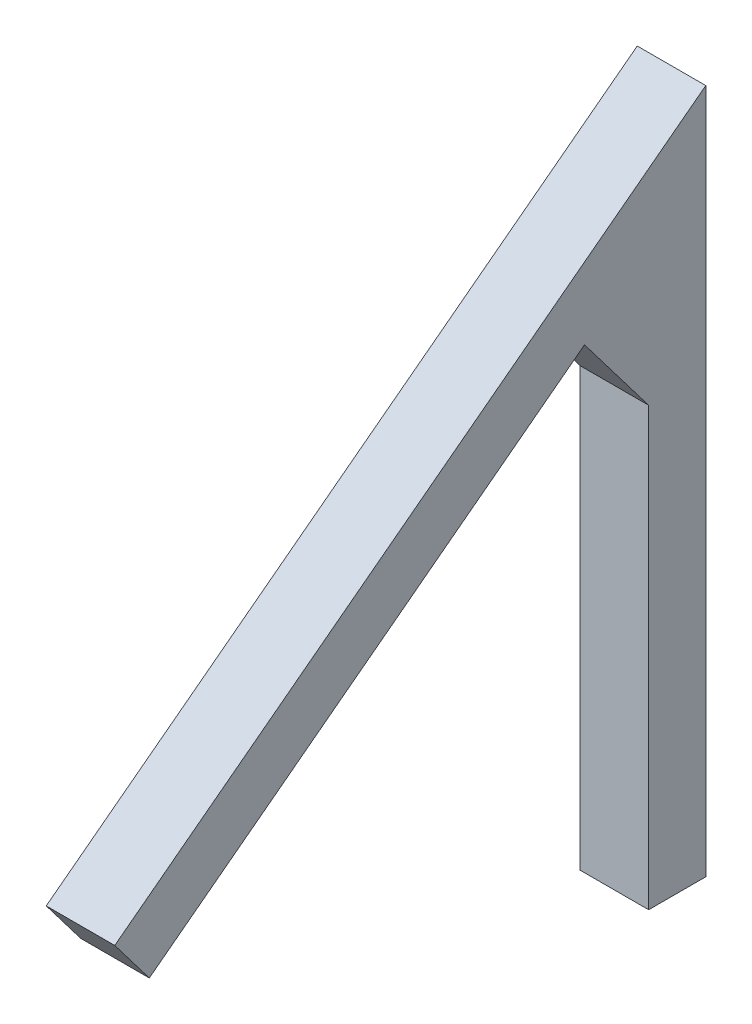
ISO-10303-21;
HEADER;
FILE_DESCRIPTION(('STEP AP214'),'2;1');
FILE_NAME('part.step','',(''),(''),'','','');
FILE_SCHEMA(('AUTOMOTIVE_DESIGN { 1 0 10303 214 1 1 1 1 }'));
ENDSEC;
DATA;
#1=APPLICATION_CONTEXT('core data for automotive mechanical design processes');
#2=APPLICATION_PROTOCOL_DEFINITION('international standard','automotive_design',2000,#1);
#3=PRODUCT_CONTEXT('',#1,'mechanical');
#4=PRODUCT('Part','Part','',(#3));
#5=PRODUCT_RELATED_PRODUCT_CATEGORY('part','',(#4));
#6=PRODUCT_DEFINITION_FORMATION('','',#4);
#7=PRODUCT_DEFINITION_CONTEXT('part definition',#1,'design');
#8=PRODUCT_DEFINITION('design','',#6,#7);
#9=PRODUCT_DEFINITION_SHAPE('','',#8);
#10=(LENGTH_UNIT() NAMED_UNIT(*) SI_UNIT(.MILLI.,.METRE.));
#11=(NAMED_UNIT(*) PLANE_ANGLE_UNIT() SI_UNIT($,.RADIAN.));
#12=(NAMED_UNIT(*) SI_UNIT($,.STERADIAN.) SOLID_ANGLE_UNIT());
#13=UNCERTAINTY_MEASURE_WITH_UNIT(LENGTH_MEASURE(1.E-05),#10,'distance_accuracy_value','');
#14=(GEOMETRIC_REPRESENTATION_CONTEXT(3) GLOBAL_UNCERTAINTY_ASSIGNED_CONTEXT((#13)) GLOBAL_UNIT_ASSIGNED_CONTEXT((#10,
#11,#12)) REPRESENTATION_CONTEXT('',''));
#15=CARTESIAN_POINT('',(0.,0.,0.));
#16=DIRECTION('',(0.,0.,1.));
#17=DIRECTION('',(1.,0.,0.));
#18=AXIS2_PLACEMENT_3D('',#15,#16,#17);
#19=CARTESIAN_POINT('',(6.,-14.9683199920836,4.99999999999995));
#20=DIRECTION('',(0.,1.,0.));
#21=DIRECTION('',(0.,0.,1.));
#22=AXIS2_PLACEMENT_3D('',#19,#20,#21);
#23=PLANE('',#22);
#24=DIRECTION('',(0.,0.,-1.));
#25=VECTOR('',#24,1.);
#26=CARTESIAN_POINT('',(0.,-14.9683199920836,4.99999999999995));
#27=LINE('',#26,#25);
#28=CARTESIAN_POINT('',(0.,-14.9683199920836,4.99999999999995));
#29=VERTEX_POINT('',#28);
#30=CARTESIAN_POINT('',(0.,-14.9683199920836,0.));
#31=VERTEX_POINT('',#30);
#32=EDGE_CURVE('E134',#29,#31,#27,.T.);
#33=ORIENTED_EDGE('',*,*,#32,.T.);
#34=DIRECTION('',(-1.,0.,0.));
#35=VECTOR('',#34,1.);
#36=CARTESIAN_POINT('',(6.,-14.9683199920836,0.));
#37=LINE('',#36,#35);
#38=CARTESIAN_POINT('',(6.,-14.9683199920836,0.));
#39=VERTEX_POINT('',#38);
#40=EDGE_CURVE('E11',#39,#31,#37,.T.);
#41=ORIENTED_EDGE('',*,*,#40,.F.);
#42=DIRECTION('',(0.,0.,-1.));
#43=VECTOR('',#42,1.);
#44=CARTESIAN_POINT('',(6.,-14.9683199920836,4.99999999999995));
#45=LINE('',#44,#43);
#46=CARTESIAN_POINT('',(6.,-14.9683199920836,4.99999999999995));
#47=VERTEX_POINT('',#46);
#48=EDGE_CURVE('E153',#47,#39,#45,.T.);
#49=ORIENTED_EDGE('',*,*,#48,.F.);
#50=DIRECTION('',(-1.,0.,0.));
#51=VECTOR('',#50,1.);
#52=CARTESIAN_POINT('',(6.,-14.9683199920836,4.99999999999995));
#53=LINE('',#52,#51);
#54=EDGE_CURVE('E130',#47,#29,#53,.T.);
#55=ORIENTED_EDGE('',*,*,#54,.T.);
#56=EDGE_LOOP('',(#33,#41,#49,#55));
#57=FACE_BOUND('',#56,.T.);
#58=ADVANCED_FACE('F39',(#57),#23,.F.);
#59=CARTESIAN_POINT('',(6.,-14.9683199920836,0.));
#60=DIRECTION('',(0.,0.,1.));
#61=DIRECTION('',(0.,-1.,0.));
#62=AXIS2_PLACEMENT_3D('',#59,#60,#61);
#63=PLANE('',#62);
#64=DIRECTION('',(0.,1.,0.));
#65=VECTOR('',#64,1.);
#66=CARTESIAN_POINT('',(0.,-14.9683199920836,0.));
#67=LINE('',#66,#65);
#68=CARTESIAN_POINT('',(0.,45.0316800079164,0.));
#69=VERTEX_POINT('',#68);
#70=EDGE_CURVE('E138',#31,#69,#67,.T.);
#71=ORIENTED_EDGE('',*,*,#70,.T.);
#72=DIRECTION('',(-1.,0.,0.));
#73=VECTOR('',#72,1.);
#74=CARTESIAN_POINT('',(6.,45.0316800079164,0.));
#75=LINE('',#74,#73);
#76=CARTESIAN_POINT('',(6.,45.0316800079164,0.));
#77=VERTEX_POINT('',#76);
#78=EDGE_CURVE('E48',#77,#69,#75,.T.);
#79=ORIENTED_EDGE('',*,*,#78,.F.);
#80=DIRECTION('',(0.,1.,0.));
#81=VECTOR('',#80,1.);
#82=CARTESIAN_POINT('',(6.,-14.9683199920836,0.));
#83=LINE('',#82,#81);
#84=EDGE_CURVE('E96',#39,#77,#83,.T.);
#85=ORIENTED_EDGE('',*,*,#84,.F.);
#86=ORIENTED_EDGE('',*,*,#40,.T.);
#87=EDGE_LOOP('',(#71,#79,#85,#86));
#88=FACE_BOUND('',#87,.T.);
#89=ADVANCED_FACE('F187',(#88),#63,.F.);
#90=CARTESIAN_POINT('',(6.,45.0316800079164,0.));
#91=DIRECTION('',(0.,-0.796162194123098,-0.605083267533564));
#92=DIRECTION('',(0.,0.605083267533564,-0.796162194123098));
#93=AXIS2_PLACEMENT_3D('',#90,#91,#92);
#94=PLANE('',#93);
#95=DIRECTION('',(0.,-0.605083267533564,0.796162194123098));
#96=VECTOR('',#95,1.);
#97=CARTESIAN_POINT('',(0.,45.0316800079164,0.));
#98=LINE('',#97,#96);
#99=CARTESIAN_POINT('',(0.,5.70126761823477,51.7505426180013));
#100=VERTEX_POINT('',#99);
#101=EDGE_CURVE('E141',#69,#100,#98,.T.);
#102=ORIENTED_EDGE('',*,*,#101,.T.);
#103=DIRECTION('',(-1.,0.,0.));
#104=VECTOR('',#103,1.);
#105=CARTESIAN_POINT('',(6.,5.70126761823477,51.7505426180013));
#106=LINE('',#105,#104);
#107=CARTESIAN_POINT('',(6.,5.70126761823477,51.7505426180013));
#108=VERTEX_POINT('',#107);
#109=EDGE_CURVE('E160',#108,#100,#106,.T.);
#110=ORIENTED_EDGE('',*,*,#109,.F.);
#111=DIRECTION('',(0.,-0.605083267533564,0.796162194123098));
#112=VECTOR('',#111,1.);
#113=CARTESIAN_POINT('',(6.,45.0316800079164,0.));
#114=LINE('',#113,#112);
#115=EDGE_CURVE('E170',#77,#108,#114,.T.);
#116=ORIENTED_EDGE('',*,*,#115,.F.);
#117=ORIENTED_EDGE('',*,*,#78,.T.);
#118=EDGE_LOOP('',(#102,#110,#116,#117));
#119=FACE_BOUND('',#118,.T.);
#120=ADVANCED_FACE('F168',(#119),#94,.F.);
#121=CARTESIAN_POINT('',(6.,5.70126761823477,51.7505426180013));
#122=DIRECTION('',(0.,0.605083267533564,-0.796162194123098));
#123=DIRECTION('',(0.,0.796162194123098,0.605083267533564));
#124=AXIS2_PLACEMENT_3D('',#121,#122,#123);
#125=PLANE('',#124);
#126=DIRECTION('',(0.,-0.796162194123098,-0.605083267533564));
#127=VECTOR('',#126,1.);
#128=CARTESIAN_POINT('',(0.,5.70126761823477,51.7505426180013));
#129=LINE('',#128,#127);
#130=CARTESIAN_POINT('',(0.,1.72045664761928,48.7251262803335));
#131=VERTEX_POINT('',#130);
#132=EDGE_CURVE('E144',#100,#131,#129,.T.);
#133=ORIENTED_EDGE('',*,*,#132,.T.);
#134=DIRECTION('',(-1.,0.,0.));
#135=VECTOR('',#134,1.);
#136=CARTESIAN_POINT('',(6.,1.72045664761928,48.7251262803335));
#137=LINE('',#136,#135);
#138=CARTESIAN_POINT('',(6.,1.72045664761928,48.7251262803335));
#139=VERTEX_POINT('',#138);
#140=EDGE_CURVE('E123',#139,#131,#137,.T.);
#141=ORIENTED_EDGE('',*,*,#140,.F.);
#142=DIRECTION('',(0.,-0.796162194123098,-0.605083267533564));
#143=VECTOR('',#142,1.);
#144=CARTESIAN_POINT('',(6.,5.70126761823477,51.7505426180013));
#145=LINE('',#144,#143);
#146=EDGE_CURVE('E112',#108,#139,#145,.T.);
#147=ORIENTED_EDGE('',*,*,#146,.F.);
#148=ORIENTED_EDGE('',*,*,#109,.T.);
#149=EDGE_LOOP('',(#133,#141,#147,#148));
#150=FACE_BOUND('',#149,.T.);
#151=ADVANCED_FACE('F176',(#150),#125,.F.);
#152=CARTESIAN_POINT('',(6.,1.72045664761928,48.7251262803335));
#153=DIRECTION('',(0.,0.796162194123098,0.605083267533564));
#154=DIRECTION('',(0.,-0.605083267533564,0.796162194123098));
#155=AXIS2_PLACEMENT_3D('',#152,#153,#154);
#156=PLANE('',#155);
#157=DIRECTION('',(0.,0.605083267533564,-0.796162194123098));
#158=VECTOR('',#157,1.);
#159=CARTESIAN_POINT('',(0.,1.72045664761928,48.7251262803335));
#160=LINE('',#159,#158);
#161=CARTESIAN_POINT('',(0.,30.6811318825711,10.6189746553975));
#162=VERTEX_POINT('',#161);
#163=EDGE_CURVE('E121',#131,#162,#160,.T.);
#164=ORIENTED_EDGE('',*,*,#163,.T.);
#165=DIRECTION('',(-1.,0.,0.));
#166=VECTOR('',#165,1.);
#167=CARTESIAN_POINT('',(6.,30.6811318825711,10.6189746553975));
#168=LINE('',#167,#166);
#169=CARTESIAN_POINT('',(6.,30.6811318825711,10.6189746553975));
#170=VERTEX_POINT('',#169);
#171=EDGE_CURVE('E118',#170,#162,#168,.T.);
#172=ORIENTED_EDGE('',*,*,#171,.F.);
#173=DIRECTION('',(0.,0.605083267533564,-0.796162194123098));
#174=VECTOR('',#173,1.);
#175=CARTESIAN_POINT('',(6.,1.72045664761928,48.7251262803335));
#176=LINE('',#175,#174);
#177=EDGE_CURVE('E106',#139,#170,#176,.T.);
#178=ORIENTED_EDGE('',*,*,#177,.F.);
#179=ORIENTED_EDGE('',*,*,#140,.T.);
#180=EDGE_LOOP('',(#164,#172,#178,#179));
#181=FACE_BOUND('',#180,.T.);
#182=ADVANCED_FACE('F119',(#181),#156,.F.);
#183=CARTESIAN_POINT('',(6.,23.2877441781008,4.99999999999996));
#184=DIRECTION('',(0.,0.605083267533564,-0.796162194123098));
#185=DIRECTION('',(0.,0.796162194123098,0.605083267533564));
#186=AXIS2_PLACEMENT_3D('',#183,#184,#185);
#187=PLANE('',#186);
#188=DIRECTION('',(0.,-0.796162194123098,-0.605083267533564));
#189=VECTOR('',#188,1.);
#190=CARTESIAN_POINT('',(0.,23.2877441781008,4.99999999999996));
#191=LINE('',#190,#189);
#192=CARTESIAN_POINT('',(0.,23.2877441781008,4.99999999999996));
#193=VERTEX_POINT('',#192);
#194=EDGE_CURVE('E82',#162,#193,#191,.T.);
#195=ORIENTED_EDGE('',*,*,#194,.T.);
#196=DIRECTION('',(-1.,0.,0.));
#197=VECTOR('',#196,1.);
#198=CARTESIAN_POINT('',(6.,23.2877441781008,4.99999999999996));
#199=LINE('',#198,#197);
#200=CARTESIAN_POINT('',(6.,23.2877441781008,4.99999999999996));
#201=VERTEX_POINT('',#200);
#202=EDGE_CURVE('E124',#201,#193,#199,.T.);
#203=ORIENTED_EDGE('',*,*,#202,.F.);
#204=DIRECTION('',(0.,-0.796162194123098,-0.605083267533564));
#205=VECTOR('',#204,1.);
#206=CARTESIAN_POINT('',(6.,23.2877441781008,4.99999999999996));
#207=LINE('',#206,#205);
#208=EDGE_CURVE('E110',#170,#201,#207,.T.);
#209=ORIENTED_EDGE('',*,*,#208,.F.);
#210=ORIENTED_EDGE('',*,*,#171,.T.);
#211=EDGE_LOOP('',(#195,#203,#209,#210));
#212=FACE_BOUND('',#211,.T.);
#213=ADVANCED_FACE('F126',(#212),#187,.F.);
#214=CARTESIAN_POINT('',(6.,23.2877441781008,4.99999999999996));
#215=DIRECTION('',(0.,0.,-1.));
#216=DIRECTION('',(0.,1.,0.));
#217=AXIS2_PLACEMENT_3D('',#214,#215,#216);
#218=PLANE('',#217);
#219=DIRECTION('',(0.,-1.,0.));
#220=VECTOR('',#219,1.);
#221=CARTESIAN_POINT('',(0.,23.2877441781008,4.99999999999996));
#222=LINE('',#221,#220);
#223=EDGE_CURVE('E88',#193,#29,#222,.T.);
#224=ORIENTED_EDGE('',*,*,#223,.T.);
#225=ORIENTED_EDGE('',*,*,#54,.F.);
#226=DIRECTION('',(0.,-1.,0.));
#227=VECTOR('',#226,1.);
#228=CARTESIAN_POINT('',(6.,23.2877441781008,4.99999999999996));
#229=LINE('',#228,#227);
#230=EDGE_CURVE('E56',#201,#47,#229,.T.);
#231=ORIENTED_EDGE('',*,*,#230,.F.);
#232=ORIENTED_EDGE('',*,*,#202,.T.);
#233=EDGE_LOOP('',(#224,#225,#231,#232));
#234=FACE_BOUND('',#233,.T.);
#235=ADVANCED_FACE('F201',(#234),#218,.F.);
#236=CARTESIAN_POINT('',(6.,0.,0.));
#237=DIRECTION('',(1.,0.,0.));
#238=DIRECTION('',(0.,0.,-1.));
#239=AXIS2_PLACEMENT_3D('',#236,#237,#238);
#240=PLANE('',#239);
#241=ORIENTED_EDGE('',*,*,#48,.T.);
#242=ORIENTED_EDGE('',*,*,#84,.T.);
#243=ORIENTED_EDGE('',*,*,#115,.T.);
#244=ORIENTED_EDGE('',*,*,#146,.T.);
#245=ORIENTED_EDGE('',*,*,#177,.T.);
#246=ORIENTED_EDGE('',*,*,#208,.T.);
#247=ORIENTED_EDGE('',*,*,#230,.T.);
#248=EDGE_LOOP('',(#241,#242,#243,#244,#245,#246,#247));
#249=FACE_BOUND('',#248,.T.);
#250=ADVANCED_FACE('F108',(#249),#240,.T.);
#251=CARTESIAN_POINT('',(0.,0.,0.));
#252=DIRECTION('',(1.,0.,0.));
#253=DIRECTION('',(0.,0.,-1.));
#254=AXIS2_PLACEMENT_3D('',#251,#252,#253);
#255=PLANE('',#254);
#256=ORIENTED_EDGE('',*,*,#32,.F.);
#257=ORIENTED_EDGE('',*,*,#223,.F.);
#258=ORIENTED_EDGE('',*,*,#194,.F.);
#259=ORIENTED_EDGE('',*,*,#163,.F.);
#260=ORIENTED_EDGE('',*,*,#132,.F.);
#261=ORIENTED_EDGE('',*,*,#101,.F.);
#262=ORIENTED_EDGE('',*,*,#70,.F.);
#263=EDGE_LOOP('',(#256,#257,#258,#259,#260,#261,#262));
#264=FACE_BOUND('',#263,.T.);
#265=ADVANCED_FACE('F174',(#264),#255,.F.);
#266=CLOSED_SHELL('',(#58,#89,#120,#151,#182,#213,#235,#250,#265));
#267=MANIFOLD_SOLID_BREP('B2',#266);
#268=ADVANCED_BREP_SHAPE_REPRESENTATION('',(#18,#267),#14);
#269=SHAPE_DEFINITION_REPRESENTATION(#9,#268);
ENDSEC;
END-ISO-10303-21;
